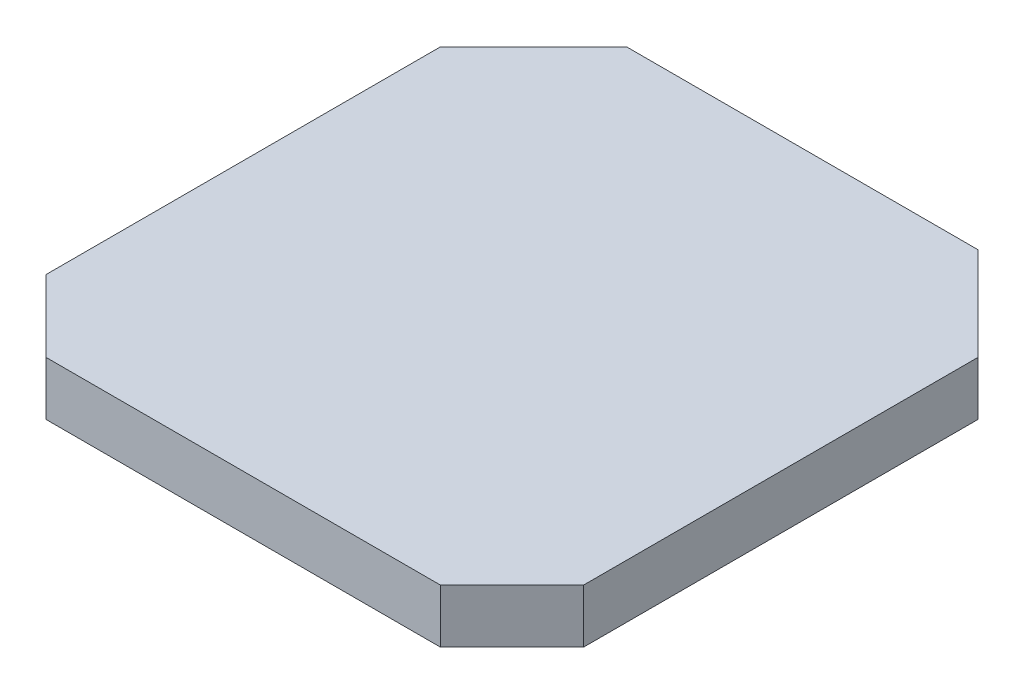
ISO-10303-21;
HEADER;
FILE_DESCRIPTION(('STEP AP214'),'2;1');
FILE_NAME('part.step','',(''),(''),'','','');
FILE_SCHEMA(('AUTOMOTIVE_DESIGN { 1 0 10303 214 1 1 1 1 }'));
ENDSEC;
DATA;
#1=APPLICATION_CONTEXT('core data for automotive mechanical design processes');
#2=APPLICATION_PROTOCOL_DEFINITION('international standard','automotive_design',2000,#1);
#3=PRODUCT_CONTEXT('',#1,'mechanical');
#4=PRODUCT('Part','Part','',(#3));
#5=PRODUCT_RELATED_PRODUCT_CATEGORY('part','',(#4));
#6=PRODUCT_DEFINITION_FORMATION('','',#4);
#7=PRODUCT_DEFINITION_CONTEXT('part definition',#1,'design');
#8=PRODUCT_DEFINITION('design','',#6,#7);
#9=PRODUCT_DEFINITION_SHAPE('','',#8);
#10=(LENGTH_UNIT() NAMED_UNIT(*) SI_UNIT(.MILLI.,.METRE.));
#11=(NAMED_UNIT(*) PLANE_ANGLE_UNIT() SI_UNIT($,.RADIAN.));
#12=(NAMED_UNIT(*) SI_UNIT($,.STERADIAN.) SOLID_ANGLE_UNIT());
#13=UNCERTAINTY_MEASURE_WITH_UNIT(LENGTH_MEASURE(1.E-05),#10,'distance_accuracy_value','');
#14=(GEOMETRIC_REPRESENTATION_CONTEXT(3) GLOBAL_UNCERTAINTY_ASSIGNED_CONTEXT((#13)) GLOBAL_UNIT_ASSIGNED_CONTEXT((#10,
#11,#12)) REPRESENTATION_CONTEXT('',''));
#15=CARTESIAN_POINT('',(0.,0.,0.));
#16=DIRECTION('',(0.,0.,1.));
#17=DIRECTION('',(1.,0.,0.));
#18=AXIS2_PLACEMENT_3D('',#15,#16,#17);
#19=CARTESIAN_POINT('',(-27.5,7.5,-37.5));
#20=DIRECTION('',(0.,0.,1.));
#21=DIRECTION('',(1.,0.,0.));
#22=AXIS2_PLACEMENT_3D('',#19,#20,#21);
#23=PLANE('',#22);
#24=DIRECTION('',(-1.,0.,0.));
#25=VECTOR('',#24,1.);
#26=CARTESIAN_POINT('',(25.,3.,-37.5));
#27=LINE('',#26,#25);
#28=CARTESIAN_POINT('',(27.5,3.,-37.5));
#29=VERTEX_POINT('',#28);
#30=CARTESIAN_POINT('',(-27.5,3.,-37.5));
#31=VERTEX_POINT('',#30);
#32=EDGE_CURVE('E133',#29,#31,#27,.T.);
#33=ORIENTED_EDGE('',*,*,#32,.F.);
#34=DIRECTION('',(0.,-1.,0.));
#35=VECTOR('',#34,1.);
#36=CARTESIAN_POINT('',(27.5,7.5,-37.5));
#37=LINE('',#36,#35);
#38=CARTESIAN_POINT('',(27.5,0.,-37.5));
#39=VERTEX_POINT('',#38);
#40=EDGE_CURVE('E173',#29,#39,#37,.T.);
#41=ORIENTED_EDGE('',*,*,#40,.T.);
#42=DIRECTION('',(-1.,0.,0.));
#43=VECTOR('',#42,1.);
#44=CARTESIAN_POINT('',(-27.5,0.,-37.5));
#45=LINE('',#44,#43);
#46=CARTESIAN_POINT('',(-27.5,0.,-37.5));
#47=VERTEX_POINT('',#46);
#48=EDGE_CURVE('E136',#39,#47,#45,.T.);
#49=ORIENTED_EDGE('',*,*,#48,.T.);
#50=DIRECTION('',(0.,-1.,0.));
#51=VECTOR('',#50,1.);
#52=CARTESIAN_POINT('',(-27.5,7.5,-37.5));
#53=LINE('',#52,#51);
#54=EDGE_CURVE('E122',#31,#47,#53,.T.);
#55=ORIENTED_EDGE('',*,*,#54,.F.);
#56=EDGE_LOOP('',(#33,#41,#49,#55));
#57=FACE_BOUND('',#56,.T.);
#58=ADVANCED_FACE('F35',(#57),#23,.F.);
#59=CARTESIAN_POINT('',(-37.5,7.5,-27.5));
#60=DIRECTION('',(0.707106781186547,0.,0.707106781186547));
#61=DIRECTION('',(0.707106781186548,0.,-0.707106781186548));
#62=AXIS2_PLACEMENT_3D('',#59,#60,#61);
#63=PLANE('',#62);
#64=DIRECTION('',(-0.707106781186548,0.,0.707106781186548));
#65=VECTOR('',#64,1.);
#66=CARTESIAN_POINT('',(-37.5,0.,-27.5));
#67=LINE('',#66,#65);
#68=CARTESIAN_POINT('',(-37.5,0.,-27.5));
#69=VERTEX_POINT('',#68);
#70=EDGE_CURVE('E157',#47,#69,#67,.T.);
#71=ORIENTED_EDGE('',*,*,#70,.T.);
#72=DIRECTION('',(0.,-1.,0.));
#73=VECTOR('',#72,1.);
#74=CARTESIAN_POINT('',(-37.5,7.5,-27.5));
#75=LINE('',#74,#73);
#76=CARTESIAN_POINT('',(-37.5,7.5,-27.5));
#77=VERTEX_POINT('',#76);
#78=EDGE_CURVE('E137',#77,#69,#75,.T.);
#79=ORIENTED_EDGE('',*,*,#78,.F.);
#80=DIRECTION('',(-0.707106781186548,0.,0.707106781186548));
#81=VECTOR('',#80,1.);
#82=CARTESIAN_POINT('',(-37.5,7.5,-27.5));
#83=LINE('',#82,#81);
#84=CARTESIAN_POINT('',(-27.5,7.5,-37.5));
#85=VERTEX_POINT('',#84);
#86=EDGE_CURVE('E125',#85,#77,#83,.T.);
#87=ORIENTED_EDGE('',*,*,#86,.F.);
#88=EDGE_CURVE('E119',#85,#31,#53,.T.);
#89=ORIENTED_EDGE('',*,*,#88,.T.);
#90=ORIENTED_EDGE('',*,*,#54,.T.);
#91=EDGE_LOOP('',(#71,#79,#87,#89,#90));
#92=FACE_BOUND('',#91,.T.);
#93=ADVANCED_FACE('F121',(#92),#63,.F.);
#94=CARTESIAN_POINT('',(-37.5,7.5,-27.5));
#95=DIRECTION('',(1.,0.,0.));
#96=DIRECTION('',(0.,0.,-1.));
#97=AXIS2_PLACEMENT_3D('',#94,#95,#96);
#98=PLANE('',#97);
#99=DIRECTION('',(0.,0.,1.));
#100=VECTOR('',#99,1.);
#101=CARTESIAN_POINT('',(-37.5,0.,-27.5));
#102=LINE('',#101,#100);
#103=CARTESIAN_POINT('',(-37.5,0.,27.5));
#104=VERTEX_POINT('',#103);
#105=EDGE_CURVE('E176',#69,#104,#102,.T.);
#106=ORIENTED_EDGE('',*,*,#105,.T.);
#107=DIRECTION('',(0.,-1.,0.));
#108=VECTOR('',#107,1.);
#109=CARTESIAN_POINT('',(-37.5,7.5,27.5));
#110=LINE('',#109,#108);
#111=CARTESIAN_POINT('',(-37.5,7.5,27.5));
#112=VERTEX_POINT('',#111);
#113=EDGE_CURVE('E203',#112,#104,#110,.T.);
#114=ORIENTED_EDGE('',*,*,#113,.F.);
#115=DIRECTION('',(0.,0.,1.));
#116=VECTOR('',#115,1.);
#117=CARTESIAN_POINT('',(-37.5,7.5,-27.5));
#118=LINE('',#117,#116);
#119=EDGE_CURVE('E161',#77,#112,#118,.T.);
#120=ORIENTED_EDGE('',*,*,#119,.F.);
#121=ORIENTED_EDGE('',*,*,#78,.T.);
#122=EDGE_LOOP('',(#106,#114,#120,#121));
#123=FACE_BOUND('',#122,.T.);
#124=ADVANCED_FACE('F222',(#123),#98,.F.);
#125=CARTESIAN_POINT('',(-37.5,7.5,27.5));
#126=DIRECTION('',(0.707106781186547,0.,-0.707106781186547));
#127=DIRECTION('',(-0.707106781186548,0.,-0.707106781186548));
#128=AXIS2_PLACEMENT_3D('',#125,#126,#127);
#129=PLANE('',#128);
#130=DIRECTION('',(0.707106781186548,0.,0.707106781186548));
#131=VECTOR('',#130,1.);
#132=CARTESIAN_POINT('',(-37.5,0.,27.5));
#133=LINE('',#132,#131);
#134=CARTESIAN_POINT('',(-27.5,0.,37.5));
#135=VERTEX_POINT('',#134);
#136=EDGE_CURVE('E178',#104,#135,#133,.T.);
#137=ORIENTED_EDGE('',*,*,#136,.T.);
#138=DIRECTION('',(0.,-1.,0.));
#139=VECTOR('',#138,1.);
#140=CARTESIAN_POINT('',(-27.5,7.5,37.5));
#141=LINE('',#140,#139);
#142=CARTESIAN_POINT('',(-27.5,7.5,37.5));
#143=VERTEX_POINT('',#142);
#144=EDGE_CURVE('E200',#143,#135,#141,.T.);
#145=ORIENTED_EDGE('',*,*,#144,.F.);
#146=DIRECTION('',(0.707106781186548,0.,0.707106781186548));
#147=VECTOR('',#146,1.);
#148=CARTESIAN_POINT('',(-37.5,7.5,27.5));
#149=LINE('',#148,#147);
#150=EDGE_CURVE('E164',#112,#143,#149,.T.);
#151=ORIENTED_EDGE('',*,*,#150,.F.);
#152=ORIENTED_EDGE('',*,*,#113,.T.);
#153=EDGE_LOOP('',(#137,#145,#151,#152));
#154=FACE_BOUND('',#153,.T.);
#155=ADVANCED_FACE('F229',(#154),#129,.F.);
#156=CARTESIAN_POINT('',(-27.5,7.5,37.5));
#157=DIRECTION('',(0.,0.,-1.));
#158=DIRECTION('',(-1.,0.,0.));
#159=AXIS2_PLACEMENT_3D('',#156,#157,#158);
#160=PLANE('',#159);
#161=DIRECTION('',(1.,0.,0.));
#162=VECTOR('',#161,1.);
#163=CARTESIAN_POINT('',(-27.5,0.,37.5));
#164=LINE('',#163,#162);
#165=CARTESIAN_POINT('',(27.5,0.,37.5));
#166=VERTEX_POINT('',#165);
#167=EDGE_CURVE('E180',#135,#166,#164,.T.);
#168=ORIENTED_EDGE('',*,*,#167,.T.);
#169=DIRECTION('',(0.,-1.,0.));
#170=VECTOR('',#169,1.);
#171=CARTESIAN_POINT('',(27.5,7.5,37.5));
#172=LINE('',#171,#170);
#173=CARTESIAN_POINT('',(27.5,7.5,37.5));
#174=VERTEX_POINT('',#173);
#175=EDGE_CURVE('E197',#174,#166,#172,.T.);
#176=ORIENTED_EDGE('',*,*,#175,.F.);
#177=DIRECTION('',(1.,0.,0.));
#178=VECTOR('',#177,1.);
#179=CARTESIAN_POINT('',(-27.5,7.5,37.5));
#180=LINE('',#179,#178);
#181=EDGE_CURVE('E166',#143,#174,#180,.T.);
#182=ORIENTED_EDGE('',*,*,#181,.F.);
#183=ORIENTED_EDGE('',*,*,#144,.T.);
#184=EDGE_LOOP('',(#168,#176,#182,#183));
#185=FACE_BOUND('',#184,.T.);
#186=ADVANCED_FACE('F232',(#185),#160,.F.);
#187=CARTESIAN_POINT('',(27.5,7.5,37.5));
#188=DIRECTION('',(-0.707106781186547,0.,-0.707106781186547));
#189=DIRECTION('',(-0.707106781186548,0.,0.707106781186548));
#190=AXIS2_PLACEMENT_3D('',#187,#188,#189);
#191=PLANE('',#190);
#192=DIRECTION('',(0.707106781186548,0.,-0.707106781186548));
#193=VECTOR('',#192,1.);
#194=CARTESIAN_POINT('',(27.5,0.,37.5));
#195=LINE('',#194,#193);
#196=CARTESIAN_POINT('',(37.5,0.,27.5));
#197=VERTEX_POINT('',#196);
#198=EDGE_CURVE('E182',#166,#197,#195,.T.);
#199=ORIENTED_EDGE('',*,*,#198,.T.);
#200=DIRECTION('',(0.,-1.,0.));
#201=VECTOR('',#200,1.);
#202=CARTESIAN_POINT('',(37.5,7.5,27.5));
#203=LINE('',#202,#201);
#204=CARTESIAN_POINT('',(37.5,7.5,27.5));
#205=VERTEX_POINT('',#204);
#206=EDGE_CURVE('E194',#205,#197,#203,.T.);
#207=ORIENTED_EDGE('',*,*,#206,.F.);
#208=DIRECTION('',(0.707106781186548,0.,-0.707106781186548));
#209=VECTOR('',#208,1.);
#210=CARTESIAN_POINT('',(27.5,7.5,37.5));
#211=LINE('',#210,#209);
#212=EDGE_CURVE('E168',#174,#205,#211,.T.);
#213=ORIENTED_EDGE('',*,*,#212,.F.);
#214=ORIENTED_EDGE('',*,*,#175,.T.);
#215=EDGE_LOOP('',(#199,#207,#213,#214));
#216=FACE_BOUND('',#215,.T.);
#217=ADVANCED_FACE('F237',(#216),#191,.F.);
#218=CARTESIAN_POINT('',(37.5,7.5,-27.5));
#219=DIRECTION('',(-1.,0.,0.));
#220=DIRECTION('',(0.,0.,1.));
#221=AXIS2_PLACEMENT_3D('',#218,#219,#220);
#222=PLANE('',#221);
#223=DIRECTION('',(0.,0.,-1.));
#224=VECTOR('',#223,1.);
#225=CARTESIAN_POINT('',(37.5,0.,-27.5));
#226=LINE('',#225,#224);
#227=CARTESIAN_POINT('',(37.5,0.,-27.5));
#228=VERTEX_POINT('',#227);
#229=EDGE_CURVE('E184',#197,#228,#226,.T.);
#230=ORIENTED_EDGE('',*,*,#229,.T.);
#231=DIRECTION('',(0.,-1.,0.));
#232=VECTOR('',#231,1.);
#233=CARTESIAN_POINT('',(37.5,7.5,-27.5));
#234=LINE('',#233,#232);
#235=CARTESIAN_POINT('',(37.5,7.5,-27.5));
#236=VERTEX_POINT('',#235);
#237=EDGE_CURVE('E191',#236,#228,#234,.T.);
#238=ORIENTED_EDGE('',*,*,#237,.F.);
#239=DIRECTION('',(0.,0.,-1.));
#240=VECTOR('',#239,1.);
#241=CARTESIAN_POINT('',(37.5,7.5,-27.5));
#242=LINE('',#241,#240);
#243=EDGE_CURVE('E170',#205,#236,#242,.T.);
#244=ORIENTED_EDGE('',*,*,#243,.F.);
#245=ORIENTED_EDGE('',*,*,#206,.T.);
#246=EDGE_LOOP('',(#230,#238,#244,#245));
#247=FACE_BOUND('',#246,.T.);
#248=ADVANCED_FACE('F240',(#247),#222,.F.);
#249=CARTESIAN_POINT('',(27.5,7.5,-37.5));
#250=DIRECTION('',(-0.707106781186547,0.,0.707106781186547));
#251=DIRECTION('',(0.707106781186548,0.,0.707106781186548));
#252=AXIS2_PLACEMENT_3D('',#249,#250,#251);
#253=PLANE('',#252);
#254=DIRECTION('',(-0.707106781186548,0.,-0.707106781186548));
#255=VECTOR('',#254,1.);
#256=CARTESIAN_POINT('',(27.5,0.,-37.5));
#257=LINE('',#256,#255);
#258=EDGE_CURVE('E162',#228,#39,#257,.T.);
#259=ORIENTED_EDGE('',*,*,#258,.T.);
#260=ORIENTED_EDGE('',*,*,#40,.F.);
#261=CARTESIAN_POINT('',(27.5,7.5,-37.5));
#262=VERTEX_POINT('',#261);
#263=EDGE_CURVE('E188',#262,#29,#37,.T.);
#264=ORIENTED_EDGE('',*,*,#263,.F.);
#265=DIRECTION('',(-0.707106781186548,0.,-0.707106781186548));
#266=VECTOR('',#265,1.);
#267=CARTESIAN_POINT('',(27.5,7.5,-37.5));
#268=LINE('',#267,#266);
#269=EDGE_CURVE('E172',#236,#262,#268,.T.);
#270=ORIENTED_EDGE('',*,*,#269,.F.);
#271=ORIENTED_EDGE('',*,*,#237,.T.);
#272=EDGE_LOOP('',(#259,#260,#264,#270,#271));
#273=FACE_BOUND('',#272,.T.);
#274=ADVANCED_FACE('F212',(#273),#253,.F.);
#275=CARTESIAN_POINT('',(0.,7.5,0.));
#276=DIRECTION('',(0.,-1.,0.));
#277=DIRECTION('',(0.,0.,-1.));
#278=AXIS2_PLACEMENT_3D('',#275,#276,#277);
#279=PLANE('',#278);
#280=DIRECTION('',(1.,0.,0.));
#281=VECTOR('',#280,1.);
#282=CARTESIAN_POINT('',(-25.,7.5,-40.5));
#283=LINE('',#282,#281);
#284=CARTESIAN_POINT('',(-24.5,7.5,-40.5));
#285=VERTEX_POINT('',#284);
#286=CARTESIAN_POINT('',(24.5,7.50000000000005,-40.5));
#287=VERTEX_POINT('',#286);
#288=EDGE_CURVE('E142',#285,#287,#283,.T.);
#289=ORIENTED_EDGE('',*,*,#288,.F.);
#290=DIRECTION('',(-0.707106781186546,0.,0.707106781186549));
#291=VECTOR('',#290,1.);
#292=CARTESIAN_POINT('',(-24.5,7.5,-40.5));
#293=LINE('',#292,#291);
#294=EDGE_CURVE('E59',#285,#85,#293,.T.);
#295=ORIENTED_EDGE('',*,*,#294,.T.);
#296=ORIENTED_EDGE('',*,*,#86,.T.);
#297=ORIENTED_EDGE('',*,*,#119,.T.);
#298=ORIENTED_EDGE('',*,*,#150,.T.);
#299=ORIENTED_EDGE('',*,*,#181,.T.);
#300=ORIENTED_EDGE('',*,*,#212,.T.);
#301=ORIENTED_EDGE('',*,*,#243,.T.);
#302=ORIENTED_EDGE('',*,*,#269,.T.);
#303=DIRECTION('',(-0.707106781186546,0.,-0.707106781186549));
#304=VECTOR('',#303,1.);
#305=CARTESIAN_POINT('',(24.5,7.5,-40.5));
#306=LINE('',#305,#304);
#307=EDGE_CURVE('E51',#262,#287,#306,.T.);
#308=ORIENTED_EDGE('',*,*,#307,.T.);
#309=EDGE_LOOP('',(#289,#295,#296,#297,#298,#299,#300,#301,#302,#308));
#310=FACE_BOUND('',#309,.T.);
#311=ADVANCED_FACE('F154',(#310),#279,.F.);
#312=CARTESIAN_POINT('',(0.,0.,0.));
#313=DIRECTION('',(0.,-1.,0.));
#314=DIRECTION('',(0.,0.,-1.));
#315=AXIS2_PLACEMENT_3D('',#312,#313,#314);
#316=PLANE('',#315);
#317=ORIENTED_EDGE('',*,*,#48,.F.);
#318=ORIENTED_EDGE('',*,*,#258,.F.);
#319=ORIENTED_EDGE('',*,*,#229,.F.);
#320=ORIENTED_EDGE('',*,*,#198,.F.);
#321=ORIENTED_EDGE('',*,*,#167,.F.);
#322=ORIENTED_EDGE('',*,*,#136,.F.);
#323=ORIENTED_EDGE('',*,*,#105,.F.);
#324=ORIENTED_EDGE('',*,*,#70,.F.);
#325=EDGE_LOOP('',(#317,#318,#319,#320,#321,#322,#323,#324));
#326=FACE_BOUND('',#325,.T.);
#327=ADVANCED_FACE('F217',(#326),#316,.T.);
#328=CARTESIAN_POINT('',(0.,0.,-40.5));
#329=DIRECTION('',(0.,0.,-1.));
#330=DIRECTION('',(-1.,0.,0.));
#331=AXIS2_PLACEMENT_3D('',#328,#329,#330);
#332=PLANE('',#331);
#333=DIRECTION('',(-1.,0.,0.));
#334=VECTOR('',#333,1.);
#335=CARTESIAN_POINT('',(-27.5,6.00000000000001,-40.5));
#336=LINE('',#335,#334);
#337=CARTESIAN_POINT('',(24.5,6.00000000000001,-40.5));
#338=VERTEX_POINT('',#337);
#339=CARTESIAN_POINT('',(-24.5,6.00000000000001,-40.5));
#340=VERTEX_POINT('',#339);
#341=EDGE_CURVE('E127',#338,#340,#336,.T.);
#342=ORIENTED_EDGE('',*,*,#341,.T.);
#343=DIRECTION('',(0.,1.,0.));
#344=VECTOR('',#343,1.);
#345=CARTESIAN_POINT('',(-24.5,7.5,-40.5));
#346=LINE('',#345,#344);
#347=EDGE_CURVE('E145',#340,#285,#346,.T.);
#348=ORIENTED_EDGE('',*,*,#347,.T.);
#349=ORIENTED_EDGE('',*,*,#288,.T.);
#350=DIRECTION('',(0.,-1.,0.));
#351=VECTOR('',#350,1.);
#352=CARTESIAN_POINT('',(24.5,6.00000000000001,-40.5));
#353=LINE('',#352,#351);
#354=EDGE_CURVE('E147',#287,#338,#353,.T.);
#355=ORIENTED_EDGE('',*,*,#354,.T.);
#356=EDGE_LOOP('',(#342,#348,#349,#355));
#357=FACE_BOUND('',#356,.T.);
#358=ADVANCED_FACE('F207',(#357),#332,.T.);
#359=CARTESIAN_POINT('',(0.,6.00000000000001,-40.5));
#360=DIRECTION('',(0.,-0.707106781186549,-0.707106781186546));
#361=DIRECTION('',(1.,0.,0.));
#362=AXIS2_PLACEMENT_3D('',#359,#360,#361);
#363=PLANE('',#362);
#364=ORIENTED_EDGE('',*,*,#32,.T.);
#365=DIRECTION('',(0.577350269189625,0.577350269189625,-0.577350269189628));
#366=VECTOR('',#365,1.);
#367=CARTESIAN_POINT('',(-16.3333333333334,14.1666666666666,-48.6666666666667));
#368=LINE('',#367,#366);
#369=EDGE_CURVE('E11',#31,#340,#368,.T.);
#370=ORIENTED_EDGE('',*,*,#369,.T.);
#371=ORIENTED_EDGE('',*,*,#341,.F.);
#372=DIRECTION('',(0.577350269189625,-0.577350269189625,0.577350269189628));
#373=VECTOR('',#372,1.);
#374=CARTESIAN_POINT('',(16.3333333333333,14.1666666666666,-48.6666666666667));
#375=LINE('',#374,#373);
#376=EDGE_CURVE('E44',#338,#29,#375,.T.);
#377=ORIENTED_EDGE('',*,*,#376,.T.);
#378=EDGE_LOOP('',(#364,#370,#371,#377));
#379=FACE_BOUND('',#378,.T.);
#380=ADVANCED_FACE('F139',(#379),#363,.T.);
#381=CARTESIAN_POINT('',(-24.5,0.,-40.5));
#382=DIRECTION('',(-0.707106781186549,0.,-0.707106781186546));
#383=DIRECTION('',(0.,-1.,0.));
#384=AXIS2_PLACEMENT_3D('',#381,#382,#383);
#385=PLANE('',#384);
#386=ORIENTED_EDGE('',*,*,#369,.F.);
#387=ORIENTED_EDGE('',*,*,#88,.F.);
#388=ORIENTED_EDGE('',*,*,#294,.F.);
#389=ORIENTED_EDGE('',*,*,#347,.F.);
#390=EDGE_LOOP('',(#386,#387,#388,#389));
#391=FACE_BOUND('',#390,.T.);
#392=ADVANCED_FACE('F144',(#391),#385,.T.);
#393=CARTESIAN_POINT('',(24.5,0.,-40.5));
#394=DIRECTION('',(0.707106781186549,0.,-0.707106781186546));
#395=DIRECTION('',(0.,1.,0.));
#396=AXIS2_PLACEMENT_3D('',#393,#394,#395);
#397=PLANE('',#396);
#398=ORIENTED_EDGE('',*,*,#307,.F.);
#399=ORIENTED_EDGE('',*,*,#263,.T.);
#400=ORIENTED_EDGE('',*,*,#376,.F.);
#401=ORIENTED_EDGE('',*,*,#354,.F.);
#402=EDGE_LOOP('',(#398,#399,#400,#401));
#403=FACE_BOUND('',#402,.T.);
#404=ADVANCED_FACE('F38',(#403),#397,.T.);
#405=CLOSED_SHELL('',(#58,#93,#124,#155,#186,#217,#248,#274,#311,#327,#358,#380,#392,#404));
#406=MANIFOLD_SOLID_BREP('B2',#405);
#407=ADVANCED_BREP_SHAPE_REPRESENTATION('',(#18,#406),#14);
#408=SHAPE_DEFINITION_REPRESENTATION(#9,#407);
ENDSEC;
END-ISO-10303-21;
